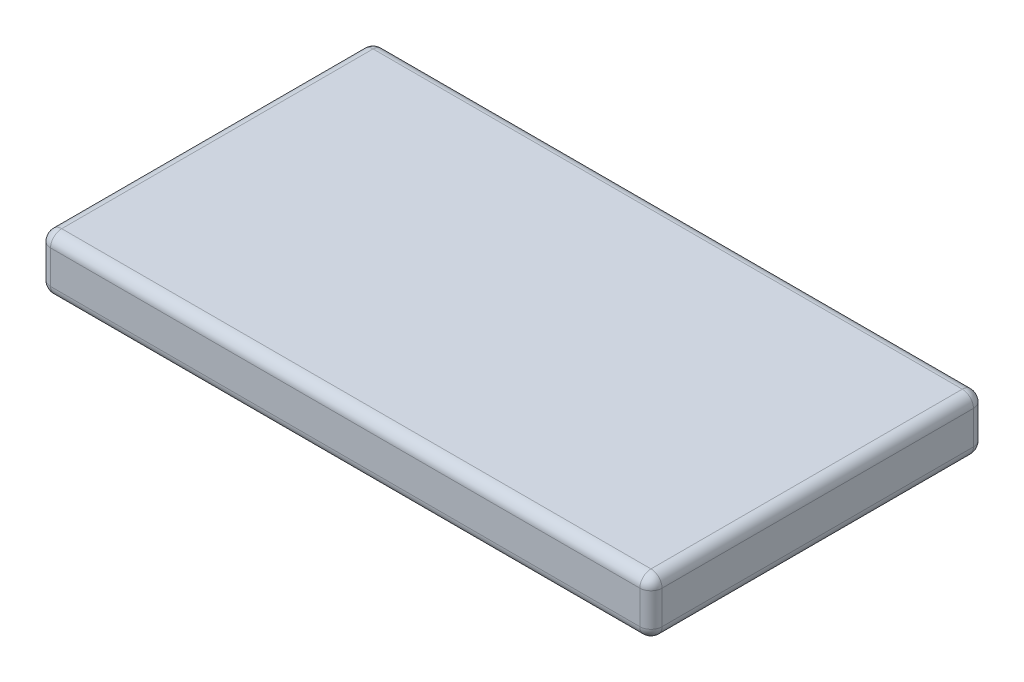
ISO-10303-21;
HEADER;
FILE_DESCRIPTION(('STEP AP214'),'2;1');
FILE_NAME('part.step','',(''),(''),'','','');
FILE_SCHEMA(('AUTOMOTIVE_DESIGN { 1 0 10303 214 1 1 1 1 }'));
ENDSEC;
DATA;
#1=APPLICATION_CONTEXT('core data for automotive mechanical design processes');
#2=APPLICATION_PROTOCOL_DEFINITION('international standard','automotive_design',2000,#1);
#3=PRODUCT_CONTEXT('',#1,'mechanical');
#4=PRODUCT('Part','Part','',(#3));
#5=PRODUCT_RELATED_PRODUCT_CATEGORY('part','',(#4));
#6=PRODUCT_DEFINITION_FORMATION('','',#4);
#7=PRODUCT_DEFINITION_CONTEXT('part definition',#1,'design');
#8=PRODUCT_DEFINITION('design','',#6,#7);
#9=PRODUCT_DEFINITION_SHAPE('','',#8);
#10=(LENGTH_UNIT() NAMED_UNIT(*) SI_UNIT(.MILLI.,.METRE.));
#11=(NAMED_UNIT(*) PLANE_ANGLE_UNIT() SI_UNIT($,.RADIAN.));
#12=(NAMED_UNIT(*) SI_UNIT($,.STERADIAN.) SOLID_ANGLE_UNIT());
#13=UNCERTAINTY_MEASURE_WITH_UNIT(LENGTH_MEASURE(1.E-05),#10,'distance_accuracy_value','');
#14=(GEOMETRIC_REPRESENTATION_CONTEXT(3) GLOBAL_UNCERTAINTY_ASSIGNED_CONTEXT((#13)) GLOBAL_UNIT_ASSIGNED_CONTEXT((#10,
#11,#12)) REPRESENTATION_CONTEXT('',''));
#15=CARTESIAN_POINT('',(0.,0.,0.));
#16=DIRECTION('',(0.,0.,1.));
#17=DIRECTION('',(1.,0.,0.));
#18=AXIS2_PLACEMENT_3D('',#15,#16,#17);
#19=CARTESIAN_POINT('',(27.5,5.,-15.));
#20=DIRECTION('',(-1.,0.,0.));
#21=DIRECTION('',(0.,0.,1.));
#22=AXIS2_PLACEMENT_3D('',#19,#20,#21);
#23=PLANE('',#22);
#24=DIRECTION('',(0.,0.,-1.));
#25=VECTOR('',#24,1.);
#26=CARTESIAN_POINT('',(27.5,1.,-15.));
#27=LINE('',#26,#25);
#28=CARTESIAN_POINT('',(27.5,1.,14.));
#29=VERTEX_POINT('',#28);
#30=CARTESIAN_POINT('',(27.5,1.,-14.));
#31=VERTEX_POINT('',#30);
#32=EDGE_CURVE('E218',#29,#31,#27,.T.);
#33=ORIENTED_EDGE('',*,*,#32,.T.);
#34=DIRECTION('',(0.,-1.,0.));
#35=VECTOR('',#34,1.);
#36=CARTESIAN_POINT('',(27.5,5.,-14.));
#37=LINE('',#36,#35);
#38=CARTESIAN_POINT('',(27.5,4.,-14.));
#39=VERTEX_POINT('',#38);
#40=EDGE_CURVE('E216',#31,#39,#37,.F.);
#41=ORIENTED_EDGE('',*,*,#40,.T.);
#42=DIRECTION('',(0.,0.,-1.));
#43=VECTOR('',#42,1.);
#44=CARTESIAN_POINT('',(27.5,4.,15.));
#45=LINE('',#44,#43);
#46=CARTESIAN_POINT('',(27.5,4.,14.));
#47=VERTEX_POINT('',#46);
#48=EDGE_CURVE('E209',#39,#47,#45,.F.);
#49=ORIENTED_EDGE('',*,*,#48,.T.);
#50=DIRECTION('',(0.,-1.,0.));
#51=VECTOR('',#50,1.);
#52=CARTESIAN_POINT('',(27.5,5.,14.));
#53=LINE('',#52,#51);
#54=EDGE_CURVE('E212',#47,#29,#53,.T.);
#55=ORIENTED_EDGE('',*,*,#54,.T.);
#56=EDGE_LOOP('',(#33,#41,#49,#55));
#57=FACE_BOUND('',#56,.T.);
#58=ADVANCED_FACE('F34',(#57),#23,.F.);
#59=CARTESIAN_POINT('',(-27.5,5.,-15.));
#60=DIRECTION('',(0.,0.,1.));
#61=DIRECTION('',(1.,0.,0.));
#62=AXIS2_PLACEMENT_3D('',#59,#60,#61);
#63=PLANE('',#62);
#64=DIRECTION('',(-1.,0.,0.));
#65=VECTOR('',#64,1.);
#66=CARTESIAN_POINT('',(-27.5,1.,-15.));
#67=LINE('',#66,#65);
#68=CARTESIAN_POINT('',(26.5,1.,-15.));
#69=VERTEX_POINT('',#68);
#70=CARTESIAN_POINT('',(-26.5,1.,-15.));
#71=VERTEX_POINT('',#70);
#72=EDGE_CURVE('E280',#69,#71,#67,.T.);
#73=ORIENTED_EDGE('',*,*,#72,.T.);
#74=DIRECTION('',(0.,-1.,0.));
#75=VECTOR('',#74,1.);
#76=CARTESIAN_POINT('',(-26.5,5.,-15.));
#77=LINE('',#76,#75);
#78=CARTESIAN_POINT('',(-26.5,4.,-15.));
#79=VERTEX_POINT('',#78);
#80=EDGE_CURVE('E213',#71,#79,#77,.F.);
#81=ORIENTED_EDGE('',*,*,#80,.T.);
#82=DIRECTION('',(-1.,0.,0.));
#83=VECTOR('',#82,1.);
#84=CARTESIAN_POINT('',(27.5,4.,-15.));
#85=LINE('',#84,#83);
#86=CARTESIAN_POINT('',(26.5,4.,-15.));
#87=VERTEX_POINT('',#86);
#88=EDGE_CURVE('E273',#79,#87,#85,.F.);
#89=ORIENTED_EDGE('',*,*,#88,.T.);
#90=DIRECTION('',(0.,-1.,0.));
#91=VECTOR('',#90,1.);
#92=CARTESIAN_POINT('',(26.5,5.,-15.));
#93=LINE('',#92,#91);
#94=EDGE_CURVE('E275',#87,#69,#93,.T.);
#95=ORIENTED_EDGE('',*,*,#94,.T.);
#96=EDGE_LOOP('',(#73,#81,#89,#95));
#97=FACE_BOUND('',#96,.T.);
#98=ADVANCED_FACE('F305',(#97),#63,.F.);
#99=CARTESIAN_POINT('',(-27.5,5.,-15.));
#100=DIRECTION('',(1.,0.,0.));
#101=DIRECTION('',(0.,0.,-1.));
#102=AXIS2_PLACEMENT_3D('',#99,#100,#101);
#103=PLANE('',#102);
#104=DIRECTION('',(0.,-1.,0.));
#105=VECTOR('',#104,1.);
#106=CARTESIAN_POINT('',(-27.5,5.,-14.));
#107=LINE('',#106,#105);
#108=CARTESIAN_POINT('',(-27.5,4.,-14.));
#109=VERTEX_POINT('',#108);
#110=CARTESIAN_POINT('',(-27.5,1.,-14.));
#111=VERTEX_POINT('',#110);
#112=EDGE_CURVE('E132',#109,#111,#107,.T.);
#113=ORIENTED_EDGE('',*,*,#112,.T.);
#114=DIRECTION('',(0.,0.,1.));
#115=VECTOR('',#114,1.);
#116=CARTESIAN_POINT('',(-27.5,1.,-15.));
#117=LINE('',#116,#115);
#118=CARTESIAN_POINT('',(-27.5,1.,14.));
#119=VERTEX_POINT('',#118);
#120=EDGE_CURVE('E128',#111,#119,#117,.T.);
#121=ORIENTED_EDGE('',*,*,#120,.T.);
#122=DIRECTION('',(0.,-1.,0.));
#123=VECTOR('',#122,1.);
#124=CARTESIAN_POINT('',(-27.5,5.,14.));
#125=LINE('',#124,#123);
#126=CARTESIAN_POINT('',(-27.5,4.,14.));
#127=VERTEX_POINT('',#126);
#128=EDGE_CURVE('E122',#119,#127,#125,.F.);
#129=ORIENTED_EDGE('',*,*,#128,.T.);
#130=DIRECTION('',(0.,0.,1.));
#131=VECTOR('',#130,1.);
#132=CARTESIAN_POINT('',(-27.5,4.,-15.));
#133=LINE('',#132,#131);
#134=EDGE_CURVE('E125',#127,#109,#133,.F.);
#135=ORIENTED_EDGE('',*,*,#134,.T.);
#136=EDGE_LOOP('',(#113,#121,#129,#135));
#137=FACE_BOUND('',#136,.T.);
#138=ADVANCED_FACE('F124',(#137),#103,.F.);
#139=CARTESIAN_POINT('',(-27.5,5.,15.));
#140=DIRECTION('',(0.,0.,-1.));
#141=DIRECTION('',(-1.,0.,0.));
#142=AXIS2_PLACEMENT_3D('',#139,#140,#141);
#143=PLANE('',#142);
#144=DIRECTION('',(0.,-1.,0.));
#145=VECTOR('',#144,1.);
#146=CARTESIAN_POINT('',(-26.5,5.,15.));
#147=LINE('',#146,#145);
#148=CARTESIAN_POINT('',(-26.5,4.,15.));
#149=VERTEX_POINT('',#148);
#150=CARTESIAN_POINT('',(-26.5,1.,15.));
#151=VERTEX_POINT('',#150);
#152=EDGE_CURVE('E154',#149,#151,#147,.T.);
#153=ORIENTED_EDGE('',*,*,#152,.T.);
#154=DIRECTION('',(1.,0.,0.));
#155=VECTOR('',#154,1.);
#156=CARTESIAN_POINT('',(-27.5,1.,15.));
#157=LINE('',#156,#155);
#158=CARTESIAN_POINT('',(26.5,1.,15.));
#159=VERTEX_POINT('',#158);
#160=EDGE_CURVE('E231',#151,#159,#157,.T.);
#161=ORIENTED_EDGE('',*,*,#160,.T.);
#162=DIRECTION('',(0.,-1.,0.));
#163=VECTOR('',#162,1.);
#164=CARTESIAN_POINT('',(26.5,5.,15.));
#165=LINE('',#164,#163);
#166=CARTESIAN_POINT('',(26.5,4.,15.));
#167=VERTEX_POINT('',#166);
#168=EDGE_CURVE('E224',#159,#167,#165,.F.);
#169=ORIENTED_EDGE('',*,*,#168,.T.);
#170=DIRECTION('',(1.,0.,0.));
#171=VECTOR('',#170,1.);
#172=CARTESIAN_POINT('',(-27.5,4.,15.));
#173=LINE('',#172,#171);
#174=EDGE_CURVE('E222',#167,#149,#173,.F.);
#175=ORIENTED_EDGE('',*,*,#174,.T.);
#176=EDGE_LOOP('',(#153,#161,#169,#175));
#177=FACE_BOUND('',#176,.T.);
#178=ADVANCED_FACE('F490',(#177),#143,.F.);
#179=CARTESIAN_POINT('',(0.,5.,0.));
#180=DIRECTION('',(0.,1.,0.));
#181=DIRECTION('',(0.,0.,1.));
#182=AXIS2_PLACEMENT_3D('',#179,#180,#181);
#183=PLANE('',#182);
#184=DIRECTION('',(0.,0.,1.));
#185=VECTOR('',#184,1.);
#186=CARTESIAN_POINT('',(-26.5,5.,15.));
#187=LINE('',#186,#185);
#188=CARTESIAN_POINT('',(-26.5,5.,-14.));
#189=VERTEX_POINT('',#188);
#190=CARTESIAN_POINT('',(-26.5,5.,14.));
#191=VERTEX_POINT('',#190);
#192=EDGE_CURVE('E43',#189,#191,#187,.T.);
#193=ORIENTED_EDGE('',*,*,#192,.T.);
#194=DIRECTION('',(1.,0.,0.));
#195=VECTOR('',#194,1.);
#196=CARTESIAN_POINT('',(27.5,5.,14.));
#197=LINE('',#196,#195);
#198=CARTESIAN_POINT('',(26.5,5.,14.));
#199=VERTEX_POINT('',#198);
#200=EDGE_CURVE('E11',#191,#199,#197,.T.);
#201=ORIENTED_EDGE('',*,*,#200,.T.);
#202=DIRECTION('',(0.,0.,-1.));
#203=VECTOR('',#202,1.);
#204=CARTESIAN_POINT('',(26.5,5.,-15.));
#205=LINE('',#204,#203);
#206=CARTESIAN_POINT('',(26.5,5.,-14.));
#207=VERTEX_POINT('',#206);
#208=EDGE_CURVE('E233',#199,#207,#205,.T.);
#209=ORIENTED_EDGE('',*,*,#208,.T.);
#210=DIRECTION('',(-1.,0.,0.));
#211=VECTOR('',#210,1.);
#212=CARTESIAN_POINT('',(-27.5,5.,-14.));
#213=LINE('',#212,#211);
#214=EDGE_CURVE('E54',#207,#189,#213,.T.);
#215=ORIENTED_EDGE('',*,*,#214,.T.);
#216=EDGE_LOOP('',(#193,#201,#209,#215));
#217=FACE_BOUND('',#216,.T.);
#218=ADVANCED_FACE('F482',(#217),#183,.T.);
#219=CARTESIAN_POINT('',(0.,0.,0.));
#220=DIRECTION('',(0.,1.,0.));
#221=DIRECTION('',(0.,0.,1.));
#222=AXIS2_PLACEMENT_3D('',#219,#220,#221);
#223=PLANE('',#222);
#224=DIRECTION('',(1.,0.,0.));
#225=VECTOR('',#224,1.);
#226=CARTESIAN_POINT('',(0.,0.,14.));
#227=LINE('',#226,#225);
#228=CARTESIAN_POINT('',(26.5,0.,14.));
#229=VERTEX_POINT('',#228);
#230=CARTESIAN_POINT('',(-26.5,0.,14.));
#231=VERTEX_POINT('',#230);
#232=EDGE_CURVE('E269',#229,#231,#227,.F.);
#233=ORIENTED_EDGE('',*,*,#232,.T.);
#234=DIRECTION('',(0.,0.,1.));
#235=VECTOR('',#234,1.);
#236=CARTESIAN_POINT('',(-26.5,0.,0.));
#237=LINE('',#236,#235);
#238=CARTESIAN_POINT('',(-26.5,0.,-14.));
#239=VERTEX_POINT('',#238);
#240=EDGE_CURVE('E263',#231,#239,#237,.F.);
#241=ORIENTED_EDGE('',*,*,#240,.T.);
#242=DIRECTION('',(-1.,0.,0.));
#243=VECTOR('',#242,1.);
#244=CARTESIAN_POINT('',(0.,0.,-14.));
#245=LINE('',#244,#243);
#246=CARTESIAN_POINT('',(26.5,0.,-14.));
#247=VERTEX_POINT('',#246);
#248=EDGE_CURVE('E257',#239,#247,#245,.F.);
#249=ORIENTED_EDGE('',*,*,#248,.T.);
#250=DIRECTION('',(0.,0.,-1.));
#251=VECTOR('',#250,1.);
#252=CARTESIAN_POINT('',(26.5,0.,0.));
#253=LINE('',#252,#251);
#254=EDGE_CURVE('E264',#247,#229,#253,.F.);
#255=ORIENTED_EDGE('',*,*,#254,.T.);
#256=EDGE_LOOP('',(#233,#241,#249,#255));
#257=FACE_BOUND('',#256,.T.);
#258=ADVANCED_FACE('F267',(#257),#223,.F.);
#259=CARTESIAN_POINT('',(26.5,4.,0.));
#260=DIRECTION('',(0.,0.,1.));
#261=DIRECTION('',(1.,0.,0.));
#262=AXIS2_PLACEMENT_3D('',#259,#260,#261);
#263=CYLINDRICAL_SURFACE('',#262,1.);
#264=CARTESIAN_POINT('',(26.5,4.,-14.));
#265=DIRECTION('',(0.,0.,-1.));
#266=DIRECTION('',(-1.,0.,0.));
#267=AXIS2_PLACEMENT_3D('',#264,#265,#266);
#268=CIRCLE('',#267,1.);
#269=EDGE_CURVE('E38',#207,#39,#268,.T.);
#270=ORIENTED_EDGE('',*,*,#269,.F.);
#271=ORIENTED_EDGE('',*,*,#208,.F.);
#272=CARTESIAN_POINT('',(26.5,4.,14.));
#273=DIRECTION('',(0.,0.,1.));
#274=DIRECTION('',(1.,0.,0.));
#275=AXIS2_PLACEMENT_3D('',#272,#273,#274);
#276=CIRCLE('',#275,1.);
#277=EDGE_CURVE('E193',#47,#199,#276,.T.);
#278=ORIENTED_EDGE('',*,*,#277,.F.);
#279=ORIENTED_EDGE('',*,*,#48,.F.);
#280=EDGE_LOOP('',(#270,#271,#278,#279));
#281=FACE_BOUND('',#280,.T.);
#282=ADVANCED_FACE('F36',(#281),#263,.T.);
#283=CARTESIAN_POINT('',(26.5,4.,-14.));
#284=DIRECTION('',(0.,0.,1.));
#285=DIRECTION('',(1.,0.,0.));
#286=AXIS2_PLACEMENT_3D('',#283,#284,#285);
#287=SPHERICAL_SURFACE('',#286,1.);
#288=CARTESIAN_POINT('',(26.5,4.,-14.));
#289=DIRECTION('',(1.,0.,0.));
#290=DIRECTION('',(0.,0.,-1.));
#291=AXIS2_PLACEMENT_3D('',#288,#289,#290);
#292=CIRCLE('',#291,1.);
#293=EDGE_CURVE('E189',#207,#87,#292,.F.);
#294=ORIENTED_EDGE('',*,*,#293,.F.);
#295=ORIENTED_EDGE('',*,*,#269,.T.);
#296=CARTESIAN_POINT('',(26.5,4.,-14.));
#297=DIRECTION('',(0.,1.,0.));
#298=DIRECTION('',(0.,0.,1.));
#299=AXIS2_PLACEMENT_3D('',#296,#297,#298);
#300=CIRCLE('',#299,1.);
#301=EDGE_CURVE('E192',#87,#39,#300,.F.);
#302=ORIENTED_EDGE('',*,*,#301,.F.);
#303=EDGE_LOOP('',(#294,#295,#302));
#304=FACE_BOUND('',#303,.T.);
#305=ADVANCED_FACE('F206',(#304),#287,.T.);
#306=CARTESIAN_POINT('',(26.5,4.,14.));
#307=DIRECTION('',(0.,0.,1.));
#308=DIRECTION('',(1.,0.,0.));
#309=AXIS2_PLACEMENT_3D('',#306,#307,#308);
#310=SPHERICAL_SURFACE('',#309,1.);
#311=CARTESIAN_POINT('',(26.5,4.,14.));
#312=DIRECTION('',(0.,1.,0.));
#313=DIRECTION('',(0.,0.,1.));
#314=AXIS2_PLACEMENT_3D('',#311,#312,#313);
#315=CIRCLE('',#314,1.);
#316=EDGE_CURVE('E184',#47,#167,#315,.F.);
#317=ORIENTED_EDGE('',*,*,#316,.F.);
#318=ORIENTED_EDGE('',*,*,#277,.T.);
#319=CARTESIAN_POINT('',(26.5,4.,14.));
#320=DIRECTION('',(1.,0.,0.));
#321=DIRECTION('',(0.,0.,-1.));
#322=AXIS2_PLACEMENT_3D('',#319,#320,#321);
#323=CIRCLE('',#322,1.);
#324=EDGE_CURVE('E187',#167,#199,#323,.F.);
#325=ORIENTED_EDGE('',*,*,#324,.F.);
#326=EDGE_LOOP('',(#317,#318,#325));
#327=FACE_BOUND('',#326,.T.);
#328=ADVANCED_FACE('F455',(#327),#310,.T.);
#329=CARTESIAN_POINT('',(26.5,5.,-14.));
#330=DIRECTION('',(0.,-1.,0.));
#331=DIRECTION('',(0.,0.,-1.));
#332=AXIS2_PLACEMENT_3D('',#329,#330,#331);
#333=CYLINDRICAL_SURFACE('',#332,1.);
#334=ORIENTED_EDGE('',*,*,#301,.T.);
#335=ORIENTED_EDGE('',*,*,#40,.F.);
#336=CARTESIAN_POINT('',(26.5,1.,-14.));
#337=DIRECTION('',(0.,-1.,0.));
#338=DIRECTION('',(0.,0.,-1.));
#339=AXIS2_PLACEMENT_3D('',#336,#337,#338);
#340=CIRCLE('',#339,1.);
#341=EDGE_CURVE('E178',#69,#31,#340,.T.);
#342=ORIENTED_EDGE('',*,*,#341,.F.);
#343=ORIENTED_EDGE('',*,*,#94,.F.);
#344=EDGE_LOOP('',(#334,#335,#342,#343));
#345=FACE_BOUND('',#344,.T.);
#346=ADVANCED_FACE('F307',(#345),#333,.T.);
#347=CARTESIAN_POINT('',(0.,4.,-14.));
#348=DIRECTION('',(1.,0.,0.));
#349=DIRECTION('',(0.,0.,-1.));
#350=AXIS2_PLACEMENT_3D('',#347,#348,#349);
#351=CYLINDRICAL_SURFACE('',#350,1.);
#352=ORIENTED_EDGE('',*,*,#293,.T.);
#353=ORIENTED_EDGE('',*,*,#88,.F.);
#354=CARTESIAN_POINT('',(-26.5,4.,-14.));
#355=DIRECTION('',(-1.,0.,0.));
#356=DIRECTION('',(0.,0.,1.));
#357=AXIS2_PLACEMENT_3D('',#354,#355,#356);
#358=CIRCLE('',#357,1.);
#359=EDGE_CURVE('E175',#189,#79,#358,.T.);
#360=ORIENTED_EDGE('',*,*,#359,.F.);
#361=ORIENTED_EDGE('',*,*,#214,.F.);
#362=EDGE_LOOP('',(#352,#353,#360,#361));
#363=FACE_BOUND('',#362,.T.);
#364=ADVANCED_FACE('F439',(#363),#351,.T.);
#365=CARTESIAN_POINT('',(-26.5,4.,0.));
#366=DIRECTION('',(0.,0.,-1.));
#367=DIRECTION('',(-1.,0.,0.));
#368=AXIS2_PLACEMENT_3D('',#365,#366,#367);
#369=CYLINDRICAL_SURFACE('',#368,1.);
#370=CARTESIAN_POINT('',(-26.5,4.,14.));
#371=DIRECTION('',(0.,0.,1.));
#372=DIRECTION('',(1.,0.,0.));
#373=AXIS2_PLACEMENT_3D('',#370,#371,#372);
#374=CIRCLE('',#373,1.);
#375=EDGE_CURVE('E138',#191,#127,#374,.T.);
#376=ORIENTED_EDGE('',*,*,#375,.F.);
#377=ORIENTED_EDGE('',*,*,#192,.F.);
#378=CARTESIAN_POINT('',(-26.5,4.,-14.));
#379=DIRECTION('',(0.,0.,-1.));
#380=DIRECTION('',(-1.,0.,0.));
#381=AXIS2_PLACEMENT_3D('',#378,#379,#380);
#382=CIRCLE('',#381,1.);
#383=EDGE_CURVE('E141',#109,#189,#382,.T.);
#384=ORIENTED_EDGE('',*,*,#383,.F.);
#385=ORIENTED_EDGE('',*,*,#134,.F.);
#386=EDGE_LOOP('',(#376,#377,#384,#385));
#387=FACE_BOUND('',#386,.T.);
#388=ADVANCED_FACE('F137',(#387),#369,.T.);
#389=CARTESIAN_POINT('',(0.,4.,14.));
#390=DIRECTION('',(-1.,0.,0.));
#391=DIRECTION('',(0.,0.,1.));
#392=AXIS2_PLACEMENT_3D('',#389,#390,#391);
#393=CYLINDRICAL_SURFACE('',#392,1.);
#394=ORIENTED_EDGE('',*,*,#324,.T.);
#395=ORIENTED_EDGE('',*,*,#200,.F.);
#396=CARTESIAN_POINT('',(-26.5,4.,14.));
#397=DIRECTION('',(-1.,0.,0.));
#398=DIRECTION('',(0.,0.,1.));
#399=AXIS2_PLACEMENT_3D('',#396,#397,#398);
#400=CIRCLE('',#399,1.);
#401=EDGE_CURVE('E150',#149,#191,#400,.T.);
#402=ORIENTED_EDGE('',*,*,#401,.F.);
#403=ORIENTED_EDGE('',*,*,#174,.F.);
#404=EDGE_LOOP('',(#394,#395,#402,#403));
#405=FACE_BOUND('',#404,.T.);
#406=ADVANCED_FACE('F423',(#405),#393,.T.);
#407=CARTESIAN_POINT('',(26.5,5.,14.));
#408=DIRECTION('',(0.,-1.,0.));
#409=DIRECTION('',(0.,0.,-1.));
#410=AXIS2_PLACEMENT_3D('',#407,#408,#409);
#411=CYLINDRICAL_SURFACE('',#410,1.);
#412=ORIENTED_EDGE('',*,*,#316,.T.);
#413=ORIENTED_EDGE('',*,*,#168,.F.);
#414=CARTESIAN_POINT('',(26.5,1.,14.));
#415=DIRECTION('',(0.,-1.,0.));
#416=DIRECTION('',(0.,0.,-1.));
#417=AXIS2_PLACEMENT_3D('',#414,#415,#416);
#418=CIRCLE('',#417,1.);
#419=EDGE_CURVE('E170',#29,#159,#418,.T.);
#420=ORIENTED_EDGE('',*,*,#419,.F.);
#421=ORIENTED_EDGE('',*,*,#54,.F.);
#422=EDGE_LOOP('',(#412,#413,#420,#421));
#423=FACE_BOUND('',#422,.T.);
#424=ADVANCED_FACE('F291',(#423),#411,.T.);
#425=CARTESIAN_POINT('',(26.5,1.,-15.));
#426=DIRECTION('',(0.,0.,-1.));
#427=DIRECTION('',(-1.,0.,0.));
#428=AXIS2_PLACEMENT_3D('',#425,#426,#427);
#429=CYLINDRICAL_SURFACE('',#428,1.);
#430=CARTESIAN_POINT('',(26.5,1.,-14.));
#431=DIRECTION('',(0.,0.,-1.));
#432=DIRECTION('',(-1.,0.,0.));
#433=AXIS2_PLACEMENT_3D('',#430,#431,#432);
#434=CIRCLE('',#433,1.);
#435=EDGE_CURVE('E181',#31,#247,#434,.T.);
#436=ORIENTED_EDGE('',*,*,#435,.F.);
#437=ORIENTED_EDGE('',*,*,#32,.F.);
#438=CARTESIAN_POINT('',(26.5,1.,14.));
#439=DIRECTION('',(0.,0.,1.));
#440=DIRECTION('',(1.,0.,0.));
#441=AXIS2_PLACEMENT_3D('',#438,#439,#440);
#442=CIRCLE('',#441,1.);
#443=EDGE_CURVE('E167',#229,#29,#442,.T.);
#444=ORIENTED_EDGE('',*,*,#443,.F.);
#445=ORIENTED_EDGE('',*,*,#254,.F.);
#446=EDGE_LOOP('',(#436,#437,#444,#445));
#447=FACE_BOUND('',#446,.T.);
#448=ADVANCED_FACE('F288',(#447),#429,.T.);
#449=CARTESIAN_POINT('',(26.5,1.,-14.));
#450=DIRECTION('',(0.,0.,1.));
#451=DIRECTION('',(1.,0.,0.));
#452=AXIS2_PLACEMENT_3D('',#449,#450,#451);
#453=SPHERICAL_SURFACE('',#452,1.);
#454=ORIENTED_EDGE('',*,*,#341,.T.);
#455=ORIENTED_EDGE('',*,*,#435,.T.);
#456=CARTESIAN_POINT('',(26.5,1.,-14.));
#457=DIRECTION('',(1.,0.,0.));
#458=DIRECTION('',(0.,0.,-1.));
#459=AXIS2_PLACEMENT_3D('',#456,#457,#458);
#460=CIRCLE('',#459,1.);
#461=EDGE_CURVE('E158',#69,#247,#460,.F.);
#462=ORIENTED_EDGE('',*,*,#461,.F.);
#463=EDGE_LOOP('',(#454,#455,#462));
#464=FACE_BOUND('',#463,.T.);
#465=ADVANCED_FACE('F309',(#464),#453,.T.);
#466=CARTESIAN_POINT('',(-26.5,4.,-14.));
#467=DIRECTION('',(0.,0.,1.));
#468=DIRECTION('',(1.,0.,0.));
#469=AXIS2_PLACEMENT_3D('',#466,#467,#468);
#470=SPHERICAL_SURFACE('',#469,1.);
#471=ORIENTED_EDGE('',*,*,#383,.T.);
#472=ORIENTED_EDGE('',*,*,#359,.T.);
#473=CARTESIAN_POINT('',(-26.5,4.,-14.));
#474=DIRECTION('',(0.,1.,0.));
#475=DIRECTION('',(0.,0.,1.));
#476=AXIS2_PLACEMENT_3D('',#473,#474,#475);
#477=CIRCLE('',#476,1.);
#478=EDGE_CURVE('E155',#109,#79,#477,.F.);
#479=ORIENTED_EDGE('',*,*,#478,.F.);
#480=EDGE_LOOP('',(#471,#472,#479));
#481=FACE_BOUND('',#480,.T.);
#482=ADVANCED_FACE('F311',(#481),#470,.T.);
#483=CARTESIAN_POINT('',(-26.5,4.,14.));
#484=DIRECTION('',(0.,0.,1.));
#485=DIRECTION('',(1.,0.,0.));
#486=AXIS2_PLACEMENT_3D('',#483,#484,#485);
#487=SPHERICAL_SURFACE('',#486,1.);
#488=ORIENTED_EDGE('',*,*,#401,.T.);
#489=ORIENTED_EDGE('',*,*,#375,.T.);
#490=CARTESIAN_POINT('',(-26.5,4.,14.));
#491=DIRECTION('',(0.,1.,0.));
#492=DIRECTION('',(0.,0.,1.));
#493=AXIS2_PLACEMENT_3D('',#490,#491,#492);
#494=CIRCLE('',#493,1.);
#495=EDGE_CURVE('E147',#149,#127,#494,.F.);
#496=ORIENTED_EDGE('',*,*,#495,.F.);
#497=EDGE_LOOP('',(#488,#489,#496));
#498=FACE_BOUND('',#497,.T.);
#499=ADVANCED_FACE('F146',(#498),#487,.T.);
#500=CARTESIAN_POINT('',(26.5,1.,14.));
#501=DIRECTION('',(0.,0.,1.));
#502=DIRECTION('',(1.,0.,0.));
#503=AXIS2_PLACEMENT_3D('',#500,#501,#502);
#504=SPHERICAL_SURFACE('',#503,1.);
#505=ORIENTED_EDGE('',*,*,#443,.T.);
#506=ORIENTED_EDGE('',*,*,#419,.T.);
#507=CARTESIAN_POINT('',(26.5,1.,14.));
#508=DIRECTION('',(1.,0.,0.));
#509=DIRECTION('',(0.,0.,-1.));
#510=AXIS2_PLACEMENT_3D('',#507,#508,#509);
#511=CIRCLE('',#510,1.);
#512=EDGE_CURVE('E156',#229,#159,#511,.F.);
#513=ORIENTED_EDGE('',*,*,#512,.F.);
#514=EDGE_LOOP('',(#505,#506,#513));
#515=FACE_BOUND('',#514,.T.);
#516=ADVANCED_FACE('F293',(#515),#504,.T.);
#517=CARTESIAN_POINT('',(-27.5,1.,-14.));
#518=DIRECTION('',(-1.,0.,0.));
#519=DIRECTION('',(0.,0.,1.));
#520=AXIS2_PLACEMENT_3D('',#517,#518,#519);
#521=CYLINDRICAL_SURFACE('',#520,1.);
#522=ORIENTED_EDGE('',*,*,#461,.T.);
#523=ORIENTED_EDGE('',*,*,#248,.F.);
#524=CARTESIAN_POINT('',(-26.5,1.,-14.));
#525=DIRECTION('',(-1.,0.,0.));
#526=DIRECTION('',(0.,0.,1.));
#527=AXIS2_PLACEMENT_3D('',#524,#525,#526);
#528=CIRCLE('',#527,1.);
#529=EDGE_CURVE('E161',#71,#239,#528,.T.);
#530=ORIENTED_EDGE('',*,*,#529,.F.);
#531=ORIENTED_EDGE('',*,*,#72,.F.);
#532=EDGE_LOOP('',(#522,#523,#530,#531));
#533=FACE_BOUND('',#532,.T.);
#534=ADVANCED_FACE('F259',(#533),#521,.T.);
#535=CARTESIAN_POINT('',(-26.5,5.,-14.));
#536=DIRECTION('',(0.,-1.,0.));
#537=DIRECTION('',(0.,0.,-1.));
#538=AXIS2_PLACEMENT_3D('',#535,#536,#537);
#539=CYLINDRICAL_SURFACE('',#538,1.);
#540=ORIENTED_EDGE('',*,*,#478,.T.);
#541=ORIENTED_EDGE('',*,*,#80,.F.);
#542=CARTESIAN_POINT('',(-26.5,1.,-14.));
#543=DIRECTION('',(0.,-1.,0.));
#544=DIRECTION('',(0.,0.,-1.));
#545=AXIS2_PLACEMENT_3D('',#542,#543,#544);
#546=CIRCLE('',#545,1.);
#547=EDGE_CURVE('E246',#111,#71,#546,.T.);
#548=ORIENTED_EDGE('',*,*,#547,.F.);
#549=ORIENTED_EDGE('',*,*,#112,.F.);
#550=EDGE_LOOP('',(#540,#541,#548,#549));
#551=FACE_BOUND('',#550,.T.);
#552=ADVANCED_FACE('F303',(#551),#539,.T.);
#553=CARTESIAN_POINT('',(-26.5,5.,14.));
#554=DIRECTION('',(0.,-1.,0.));
#555=DIRECTION('',(0.,0.,-1.));
#556=AXIS2_PLACEMENT_3D('',#553,#554,#555);
#557=CYLINDRICAL_SURFACE('',#556,1.);
#558=ORIENTED_EDGE('',*,*,#495,.T.);
#559=ORIENTED_EDGE('',*,*,#128,.F.);
#560=CARTESIAN_POINT('',(-26.5,1.,14.));
#561=DIRECTION('',(0.,-1.,0.));
#562=DIRECTION('',(0.,0.,-1.));
#563=AXIS2_PLACEMENT_3D('',#560,#561,#562);
#564=CIRCLE('',#563,1.);
#565=EDGE_CURVE('E243',#151,#119,#564,.T.);
#566=ORIENTED_EDGE('',*,*,#565,.F.);
#567=ORIENTED_EDGE('',*,*,#152,.F.);
#568=EDGE_LOOP('',(#558,#559,#566,#567));
#569=FACE_BOUND('',#568,.T.);
#570=ADVANCED_FACE('F152',(#569),#557,.T.);
#571=CARTESIAN_POINT('',(-27.5,1.,14.));
#572=DIRECTION('',(1.,0.,0.));
#573=DIRECTION('',(0.,0.,-1.));
#574=AXIS2_PLACEMENT_3D('',#571,#572,#573);
#575=CYLINDRICAL_SURFACE('',#574,1.);
#576=ORIENTED_EDGE('',*,*,#512,.T.);
#577=ORIENTED_EDGE('',*,*,#160,.F.);
#578=CARTESIAN_POINT('',(-26.5,1.,14.));
#579=DIRECTION('',(-1.,0.,0.));
#580=DIRECTION('',(0.,0.,1.));
#581=AXIS2_PLACEMENT_3D('',#578,#579,#580);
#582=CIRCLE('',#581,1.);
#583=EDGE_CURVE('E241',#231,#151,#582,.T.);
#584=ORIENTED_EDGE('',*,*,#583,.F.);
#585=ORIENTED_EDGE('',*,*,#232,.F.);
#586=EDGE_LOOP('',(#576,#577,#584,#585));
#587=FACE_BOUND('',#586,.T.);
#588=ADVANCED_FACE('F296',(#587),#575,.T.);
#589=CARTESIAN_POINT('',(-26.5,1.,-14.));
#590=DIRECTION('',(0.,0.,1.));
#591=DIRECTION('',(1.,0.,0.));
#592=AXIS2_PLACEMENT_3D('',#589,#590,#591);
#593=SPHERICAL_SURFACE('',#592,1.);
#594=ORIENTED_EDGE('',*,*,#547,.T.);
#595=ORIENTED_EDGE('',*,*,#529,.T.);
#596=CARTESIAN_POINT('',(-26.5,1.,-14.));
#597=DIRECTION('',(0.,0.,-1.));
#598=DIRECTION('',(-1.,0.,0.));
#599=AXIS2_PLACEMENT_3D('',#596,#597,#598);
#600=CIRCLE('',#599,1.);
#601=EDGE_CURVE('E239',#111,#239,#600,.F.);
#602=ORIENTED_EDGE('',*,*,#601,.F.);
#603=EDGE_LOOP('',(#594,#595,#602));
#604=FACE_BOUND('',#603,.T.);
#605=ADVANCED_FACE('F253',(#604),#593,.T.);
#606=CARTESIAN_POINT('',(-26.5,1.,14.));
#607=DIRECTION('',(0.,0.,1.));
#608=DIRECTION('',(1.,0.,0.));
#609=AXIS2_PLACEMENT_3D('',#606,#607,#608);
#610=SPHERICAL_SURFACE('',#609,1.);
#611=ORIENTED_EDGE('',*,*,#583,.T.);
#612=ORIENTED_EDGE('',*,*,#565,.T.);
#613=CARTESIAN_POINT('',(-26.5,1.,14.));
#614=DIRECTION('',(0.,0.,1.));
#615=DIRECTION('',(1.,0.,0.));
#616=AXIS2_PLACEMENT_3D('',#613,#614,#615);
#617=CIRCLE('',#616,1.);
#618=EDGE_CURVE('E237',#231,#119,#617,.F.);
#619=ORIENTED_EDGE('',*,*,#618,.F.);
#620=EDGE_LOOP('',(#611,#612,#619));
#621=FACE_BOUND('',#620,.T.);
#622=ADVANCED_FACE('F331',(#621),#610,.T.);
#623=CARTESIAN_POINT('',(-26.5,1.,-15.));
#624=DIRECTION('',(0.,0.,1.));
#625=DIRECTION('',(1.,0.,0.));
#626=AXIS2_PLACEMENT_3D('',#623,#624,#625);
#627=CYLINDRICAL_SURFACE('',#626,1.);
#628=ORIENTED_EDGE('',*,*,#601,.T.);
#629=ORIENTED_EDGE('',*,*,#240,.F.);
#630=ORIENTED_EDGE('',*,*,#618,.T.);
#631=ORIENTED_EDGE('',*,*,#120,.F.);
#632=EDGE_LOOP('',(#628,#629,#630,#631));
#633=FACE_BOUND('',#632,.T.);
#634=ADVANCED_FACE('F328',(#633),#627,.T.);
#635=CLOSED_SHELL('',(#58,#98,#138,#178,#218,#258,#282,#305,#328,#346,#364,#388,#406,#424,#448,
#465,#482,#499,#516,#534,#552,#570,#588,#605,#622,#634));
#636=MANIFOLD_SOLID_BREP('B2',#635);
#637=ADVANCED_BREP_SHAPE_REPRESENTATION('',(#18,#636),#14);
#638=SHAPE_DEFINITION_REPRESENTATION(#9,#637);
ENDSEC;
END-ISO-10303-21;
